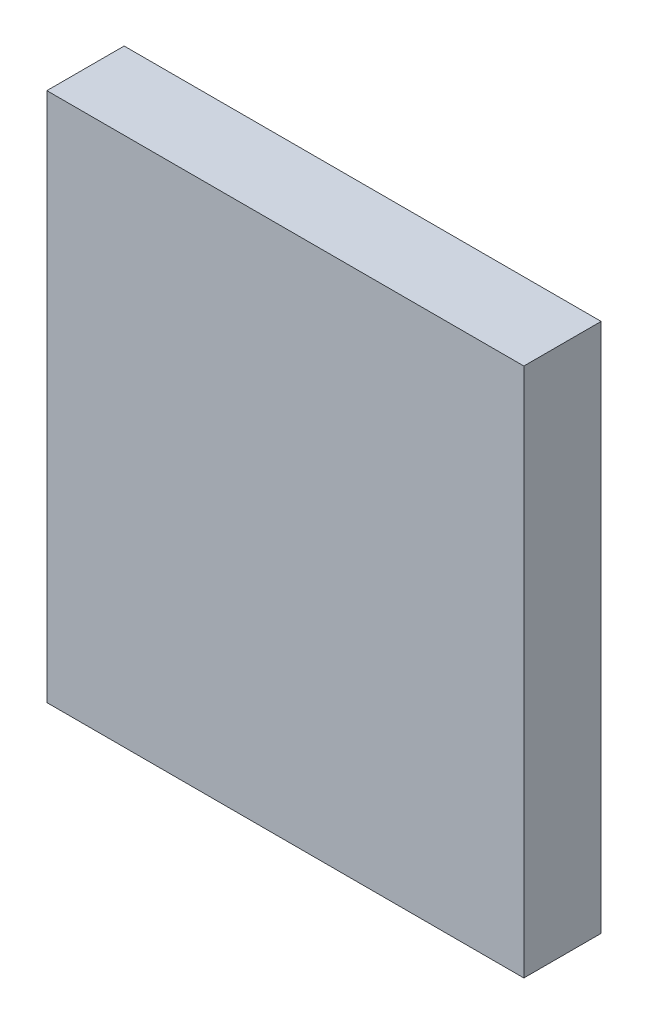
ISO-10303-21;
HEADER;
FILE_DESCRIPTION(('STEP AP214'),'2;1');
FILE_NAME('part.step','',(''),(''),'','','');
FILE_SCHEMA(('AUTOMOTIVE_DESIGN { 1 0 10303 214 1 1 1 1 }'));
ENDSEC;
DATA;
#1=APPLICATION_CONTEXT('core data for automotive mechanical design processes');
#2=APPLICATION_PROTOCOL_DEFINITION('international standard','automotive_design',2000,#1);
#3=PRODUCT_CONTEXT('',#1,'mechanical');
#4=PRODUCT('Part','Part','',(#3));
#5=PRODUCT_RELATED_PRODUCT_CATEGORY('part','',(#4));
#6=PRODUCT_DEFINITION_FORMATION('','',#4);
#7=PRODUCT_DEFINITION_CONTEXT('part definition',#1,'design');
#8=PRODUCT_DEFINITION('design','',#6,#7);
#9=PRODUCT_DEFINITION_SHAPE('','',#8);
#10=(LENGTH_UNIT() NAMED_UNIT(*) SI_UNIT(.MILLI.,.METRE.));
#11=(NAMED_UNIT(*) PLANE_ANGLE_UNIT() SI_UNIT($,.RADIAN.));
#12=(NAMED_UNIT(*) SI_UNIT($,.STERADIAN.) SOLID_ANGLE_UNIT());
#13=UNCERTAINTY_MEASURE_WITH_UNIT(LENGTH_MEASURE(1.E-05),#10,'distance_accuracy_value','');
#14=(GEOMETRIC_REPRESENTATION_CONTEXT(3) GLOBAL_UNCERTAINTY_ASSIGNED_CONTEXT((#13)) GLOBAL_UNIT_ASSIGNED_CONTEXT((#10,
#11,#12)) REPRESENTATION_CONTEXT('',''));
#15=CARTESIAN_POINT('',(0.,0.,0.));
#16=DIRECTION('',(0.,0.,1.));
#17=DIRECTION('',(1.,0.,0.));
#18=AXIS2_PLACEMENT_3D('',#15,#16,#17);
#19=CARTESIAN_POINT('',(-10.80000126,11.99999886,3.50000062));
#20=DIRECTION('',(0.,0.,-1.));
#21=DIRECTION('',(-1.,0.,0.));
#22=AXIS2_PLACEMENT_3D('',#19,#20,#21);
#23=PLANE('',#22);
#24=DIRECTION('',(1.,0.,0.));
#25=VECTOR('',#24,1.);
#26=CARTESIAN_POINT('',(-10.80000126,-11.99999886,3.50000062));
#27=LINE('',#26,#25);
#28=CARTESIAN_POINT('',(-10.80000126,-11.99999886,3.50000062));
#29=VERTEX_POINT('',#28);
#30=CARTESIAN_POINT('',(10.80000126,-11.99999886,3.50000062));
#31=VERTEX_POINT('',#30);
#32=EDGE_CURVE('E54',#29,#31,#27,.T.);
#33=ORIENTED_EDGE('',*,*,#32,.T.);
#34=DIRECTION('',(0.,1.,0.));
#35=VECTOR('',#34,1.);
#36=CARTESIAN_POINT('',(10.80000126,-11.99999886,3.50000062));
#37=LINE('',#36,#35);
#38=CARTESIAN_POINT('',(10.80000126,11.99999886,3.50000062));
#39=VERTEX_POINT('',#38);
#40=EDGE_CURVE('E56',#31,#39,#37,.T.);
#41=ORIENTED_EDGE('',*,*,#40,.T.);
#42=DIRECTION('',(1.,0.,0.));
#43=VECTOR('',#42,1.);
#44=CARTESIAN_POINT('',(10.80000126,11.99999886,3.50000062));
#45=LINE('',#44,#43);
#46=CARTESIAN_POINT('',(-10.80000126,11.99999886,3.50000062));
#47=VERTEX_POINT('',#46);
#48=EDGE_CURVE('E19',#39,#47,#45,.F.);
#49=ORIENTED_EDGE('',*,*,#48,.T.);
#50=DIRECTION('',(0.,1.,0.));
#51=VECTOR('',#50,1.);
#52=CARTESIAN_POINT('',(-10.80000126,11.99999886,3.50000062));
#53=LINE('',#52,#51);
#54=EDGE_CURVE('E79',#47,#29,#53,.F.);
#55=ORIENTED_EDGE('',*,*,#54,.T.);
#56=EDGE_LOOP('',(#33,#41,#49,#55));
#57=FACE_BOUND('',#56,.T.);
#58=ADVANCED_FACE('F16',(#57),#23,.F.);
#59=CARTESIAN_POINT('',(10.80000126,11.99999886,0.));
#60=DIRECTION('',(0.,-1.,0.));
#61=DIRECTION('',(0.,0.,-1.));
#62=AXIS2_PLACEMENT_3D('',#59,#60,#61);
#63=PLANE('',#62);
#64=DIRECTION('',(0.,0.,-1.));
#65=VECTOR('',#64,1.);
#66=CARTESIAN_POINT('',(-10.80000126,11.99999886,0.));
#67=LINE('',#66,#65);
#68=CARTESIAN_POINT('',(-10.80000126,11.99999886,0.));
#69=VERTEX_POINT('',#68);
#70=EDGE_CURVE('E67',#69,#47,#67,.F.);
#71=ORIENTED_EDGE('',*,*,#70,.T.);
#72=ORIENTED_EDGE('',*,*,#48,.F.);
#73=DIRECTION('',(0.,0.,1.));
#74=VECTOR('',#73,1.);
#75=CARTESIAN_POINT('',(10.80000126,11.99999886,0.));
#76=LINE('',#75,#74);
#77=CARTESIAN_POINT('',(10.80000126,11.99999886,0.));
#78=VERTEX_POINT('',#77);
#79=EDGE_CURVE('E62',#39,#78,#76,.F.);
#80=ORIENTED_EDGE('',*,*,#79,.T.);
#81=DIRECTION('',(-1.,0.,0.));
#82=VECTOR('',#81,1.);
#83=CARTESIAN_POINT('',(-10.80000126,11.99999886,0.));
#84=LINE('',#83,#82);
#85=EDGE_CURVE('E82',#69,#78,#84,.F.);
#86=ORIENTED_EDGE('',*,*,#85,.F.);
#87=EDGE_LOOP('',(#71,#72,#80,#86));
#88=FACE_BOUND('',#87,.T.);
#89=ADVANCED_FACE('F64',(#88),#63,.F.);
#90=CARTESIAN_POINT('',(10.80000126,-11.99999886,0.));
#91=DIRECTION('',(-1.,0.,0.));
#92=DIRECTION('',(0.,0.,1.));
#93=AXIS2_PLACEMENT_3D('',#90,#91,#92);
#94=PLANE('',#93);
#95=ORIENTED_EDGE('',*,*,#79,.F.);
#96=ORIENTED_EDGE('',*,*,#40,.F.);
#97=DIRECTION('',(0.,0.,1.));
#98=VECTOR('',#97,1.);
#99=CARTESIAN_POINT('',(10.80000126,-11.99999886,0.));
#100=LINE('',#99,#98);
#101=CARTESIAN_POINT('',(10.80000126,-11.99999886,0.));
#102=VERTEX_POINT('',#101);
#103=EDGE_CURVE('E74',#31,#102,#100,.F.);
#104=ORIENTED_EDGE('',*,*,#103,.T.);
#105=DIRECTION('',(0.,1.,0.));
#106=VECTOR('',#105,1.);
#107=CARTESIAN_POINT('',(10.80000126,11.99999886,0.));
#108=LINE('',#107,#106);
#109=EDGE_CURVE('E71',#78,#102,#108,.F.);
#110=ORIENTED_EDGE('',*,*,#109,.F.);
#111=EDGE_LOOP('',(#95,#96,#104,#110));
#112=FACE_BOUND('',#111,.T.);
#113=ADVANCED_FACE('F69',(#112),#94,.F.);
#114=CARTESIAN_POINT('',(-10.80000126,-11.99999886,0.));
#115=DIRECTION('',(0.,1.,0.));
#116=DIRECTION('',(0.,0.,1.));
#117=AXIS2_PLACEMENT_3D('',#114,#115,#116);
#118=PLANE('',#117);
#119=ORIENTED_EDGE('',*,*,#103,.F.);
#120=ORIENTED_EDGE('',*,*,#32,.F.);
#121=DIRECTION('',(0.,0.,-1.));
#122=VECTOR('',#121,1.);
#123=CARTESIAN_POINT('',(-10.80000126,-11.99999886,0.));
#124=LINE('',#123,#122);
#125=CARTESIAN_POINT('',(-10.80000126,-11.99999886,0.));
#126=VERTEX_POINT('',#125);
#127=EDGE_CURVE('E34',#29,#126,#124,.T.);
#128=ORIENTED_EDGE('',*,*,#127,.T.);
#129=DIRECTION('',(-1.,0.,0.));
#130=VECTOR('',#129,1.);
#131=CARTESIAN_POINT('',(-10.80000126,-11.99999886,0.));
#132=LINE('',#131,#130);
#133=EDGE_CURVE('E25',#102,#126,#132,.T.);
#134=ORIENTED_EDGE('',*,*,#133,.F.);
#135=EDGE_LOOP('',(#119,#120,#128,#134));
#136=FACE_BOUND('',#135,.T.);
#137=ADVANCED_FACE('F88',(#136),#118,.F.);
#138=CARTESIAN_POINT('',(-10.80000126,11.99999886,0.));
#139=DIRECTION('',(1.,0.,0.));
#140=DIRECTION('',(0.,0.,-1.));
#141=AXIS2_PLACEMENT_3D('',#138,#139,#140);
#142=PLANE('',#141);
#143=ORIENTED_EDGE('',*,*,#127,.F.);
#144=ORIENTED_EDGE('',*,*,#54,.F.);
#145=ORIENTED_EDGE('',*,*,#70,.F.);
#146=DIRECTION('',(0.,1.,0.));
#147=VECTOR('',#146,1.);
#148=CARTESIAN_POINT('',(-10.80000126,11.99999886,0.));
#149=LINE('',#148,#147);
#150=EDGE_CURVE('E10',#126,#69,#149,.T.);
#151=ORIENTED_EDGE('',*,*,#150,.F.);
#152=EDGE_LOOP('',(#143,#144,#145,#151));
#153=FACE_BOUND('',#152,.T.);
#154=ADVANCED_FACE('F90',(#153),#142,.F.);
#155=CARTESIAN_POINT('',(-10.80000126,11.99999886,0.));
#156=DIRECTION('',(0.,0.,-1.));
#157=DIRECTION('',(-1.,0.,0.));
#158=AXIS2_PLACEMENT_3D('',#155,#156,#157);
#159=PLANE('',#158);
#160=ORIENTED_EDGE('',*,*,#133,.T.);
#161=ORIENTED_EDGE('',*,*,#150,.T.);
#162=ORIENTED_EDGE('',*,*,#85,.T.);
#163=ORIENTED_EDGE('',*,*,#109,.T.);
#164=EDGE_LOOP('',(#160,#161,#162,#163));
#165=FACE_BOUND('',#164,.T.);
#166=ADVANCED_FACE('F87',(#165),#159,.T.);
#167=CLOSED_SHELL('',(#58,#89,#113,#137,#154,#166));
#168=MANIFOLD_SOLID_BREP('B1',#167);
#169=ADVANCED_BREP_SHAPE_REPRESENTATION('',(#18,#168),#14);
#170=SHAPE_DEFINITION_REPRESENTATION(#9,#169);
ENDSEC;
END-ISO-10303-21;
